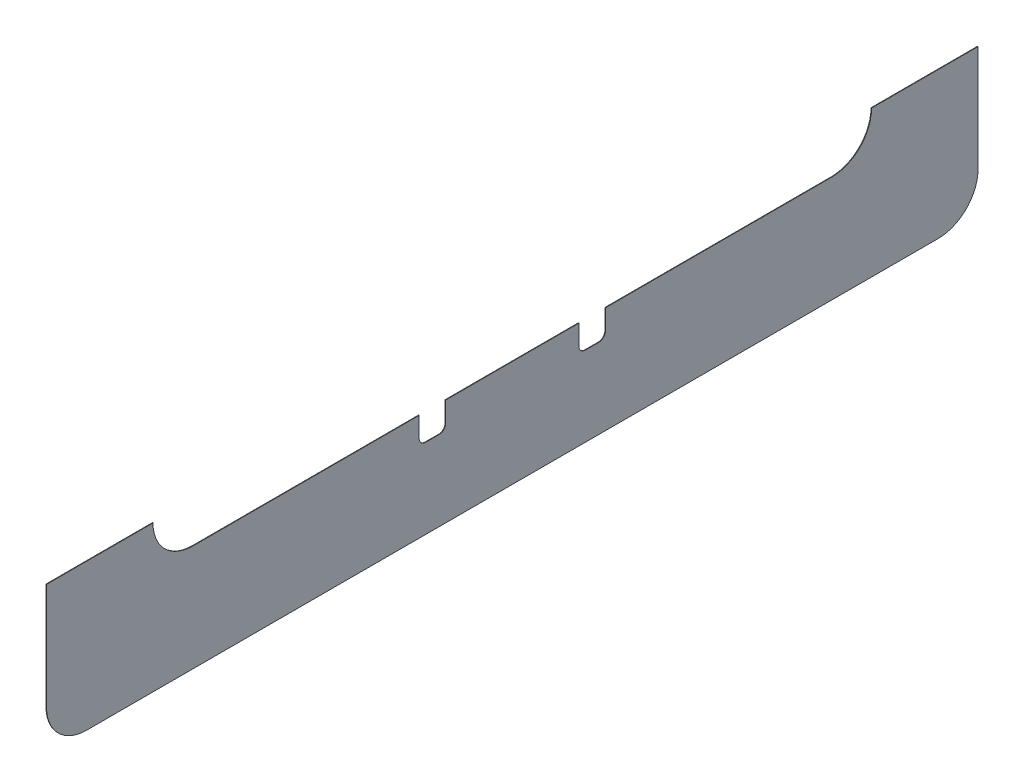
ISO-10303-21;
HEADER;
FILE_DESCRIPTION(('STEP AP214'),'2;1');
FILE_NAME('part.step','',(''),(''),'','','');
FILE_SCHEMA(('AUTOMOTIVE_DESIGN { 1 0 10303 214 1 1 1 1 }'));
ENDSEC;
DATA;
#1=APPLICATION_CONTEXT('core data for automotive mechanical design processes');
#2=APPLICATION_PROTOCOL_DEFINITION('international standard','automotive_design',2000,#1);
#3=PRODUCT_CONTEXT('',#1,'mechanical');
#4=PRODUCT('Part','Part','',(#3));
#5=PRODUCT_RELATED_PRODUCT_CATEGORY('part','',(#4));
#6=PRODUCT_DEFINITION_FORMATION('','',#4);
#7=PRODUCT_DEFINITION_CONTEXT('part definition',#1,'design');
#8=PRODUCT_DEFINITION('design','',#6,#7);
#9=PRODUCT_DEFINITION_SHAPE('','',#8);
#10=(LENGTH_UNIT() NAMED_UNIT(*) SI_UNIT(.MILLI.,.METRE.));
#11=(NAMED_UNIT(*) PLANE_ANGLE_UNIT() SI_UNIT($,.RADIAN.));
#12=(NAMED_UNIT(*) SI_UNIT($,.STERADIAN.) SOLID_ANGLE_UNIT());
#13=UNCERTAINTY_MEASURE_WITH_UNIT(LENGTH_MEASURE(1.E-05),#10,'distance_accuracy_value','');
#14=(GEOMETRIC_REPRESENTATION_CONTEXT(3) GLOBAL_UNCERTAINTY_ASSIGNED_CONTEXT((#13)) GLOBAL_UNIT_ASSIGNED_CONTEXT((#10,
#11,#12)) REPRESENTATION_CONTEXT('',''));
#15=CARTESIAN_POINT('',(0.,0.,0.));
#16=DIRECTION('',(0.,0.,1.));
#17=DIRECTION('',(1.,0.,0.));
#18=AXIS2_PLACEMENT_3D('',#15,#16,#17);
#19=CARTESIAN_POINT('',(0.254,0.,0.));
#20=DIRECTION('',(1.,0.,0.));
#21=DIRECTION('',(0.,0.,-1.));
#22=AXIS2_PLACEMENT_3D('',#19,#20,#21);
#23=PLANE('',#22);
#24=DIRECTION('',(0.,0.,1.));
#25=VECTOR('',#24,1.);
#26=CARTESIAN_POINT('',(0.254,-215.9,-222.25));
#27=LINE('',#26,#25);
#28=CARTESIAN_POINT('',(0.254,-215.9,171.45));
#29=VERTEX_POINT('',#28);
#30=CARTESIAN_POINT('',(0.254,-215.9,222.25));
#31=VERTEX_POINT('',#30);
#32=EDGE_CURVE('E194',#29,#31,#27,.T.);
#33=ORIENTED_EDGE('',*,*,#32,.T.);
#34=DIRECTION('',(0.,-1.,0.));
#35=VECTOR('',#34,1.);
#36=CARTESIAN_POINT('',(0.254,0.,222.25));
#37=LINE('',#36,#35);
#38=CARTESIAN_POINT('',(0.254,-266.7,222.25));
#39=VERTEX_POINT('',#38);
#40=EDGE_CURVE('E352',#31,#39,#37,.T.);
#41=ORIENTED_EDGE('',*,*,#40,.T.);
#42=CARTESIAN_POINT('',(0.254,-266.7,203.2));
#43=DIRECTION('',(1.,0.,0.));
#44=DIRECTION('',(0.,0.,-1.));
#45=AXIS2_PLACEMENT_3D('',#42,#43,#44);
#46=CIRCLE('',#45,19.0500000000001);
#47=CARTESIAN_POINT('',(0.254,-285.75,203.2));
#48=VERTEX_POINT('',#47);
#49=EDGE_CURVE('E354',#48,#39,#46,.F.);
#50=ORIENTED_EDGE('',*,*,#49,.F.);
#51=DIRECTION('',(0.,0.,-1.));
#52=VECTOR('',#51,1.);
#53=CARTESIAN_POINT('',(0.254,-285.75,0.));
#54=LINE('',#53,#52);
#55=CARTESIAN_POINT('',(0.254,-285.75,-203.2));
#56=VERTEX_POINT('',#55);
#57=EDGE_CURVE('E213',#48,#56,#54,.T.);
#58=ORIENTED_EDGE('',*,*,#57,.T.);
#59=CARTESIAN_POINT('',(0.254,-266.7,-203.2));
#60=DIRECTION('',(1.,0.,0.));
#61=DIRECTION('',(0.,0.,-1.));
#62=AXIS2_PLACEMENT_3D('',#59,#60,#61);
#63=CIRCLE('',#62,19.0500000000001);
#64=CARTESIAN_POINT('',(0.254,-266.7,-222.25));
#65=VERTEX_POINT('',#64);
#66=EDGE_CURVE('E207',#56,#65,#63,.T.);
#67=ORIENTED_EDGE('',*,*,#66,.T.);
#68=DIRECTION('',(0.,-1.,0.));
#69=VECTOR('',#68,1.);
#70=CARTESIAN_POINT('',(0.254,0.,-222.25));
#71=LINE('',#70,#69);
#72=CARTESIAN_POINT('',(0.254,-215.9,-222.25));
#73=VERTEX_POINT('',#72);
#74=EDGE_CURVE('E200',#73,#65,#71,.T.);
#75=ORIENTED_EDGE('',*,*,#74,.F.);
#76=CARTESIAN_POINT('',(0.254,-215.9,-171.45));
#77=VERTEX_POINT('',#76);
#78=EDGE_CURVE('E183',#73,#77,#27,.T.);
#79=ORIENTED_EDGE('',*,*,#78,.T.);
#80=CARTESIAN_POINT('',(0.254,-215.9,-152.4));
#81=DIRECTION('',(1.,0.,0.));
#82=DIRECTION('',(0.,0.,-1.));
#83=AXIS2_PLACEMENT_3D('',#80,#81,#82);
#84=CIRCLE('',#83,19.05);
#85=CARTESIAN_POINT('',(0.254,-234.95,-152.4));
#86=VERTEX_POINT('',#85);
#87=EDGE_CURVE('E209',#77,#86,#84,.F.);
#88=ORIENTED_EDGE('',*,*,#87,.T.);
#89=DIRECTION('',(0.,0.,-1.));
#90=VECTOR('',#89,1.);
#91=CARTESIAN_POINT('',(0.254,-234.95,0.));
#92=LINE('',#91,#90);
#93=CARTESIAN_POINT('',(0.254,-234.95,-44.45));
#94=VERTEX_POINT('',#93);
#95=EDGE_CURVE('E239',#94,#86,#92,.T.);
#96=ORIENTED_EDGE('',*,*,#95,.F.);
#97=DIRECTION('',(0.,-1.,0.));
#98=VECTOR('',#97,1.);
#99=CARTESIAN_POINT('',(0.254,-234.95,-44.45));
#100=LINE('',#99,#98);
#101=CARTESIAN_POINT('',(0.254,-244.475,-44.45));
#102=VERTEX_POINT('',#101);
#103=EDGE_CURVE('E307',#94,#102,#100,.T.);
#104=ORIENTED_EDGE('',*,*,#103,.T.);
#105=CARTESIAN_POINT('',(0.254,-244.475,-41.275));
#106=DIRECTION('',(-1.,0.,0.));
#107=DIRECTION('',(0.,0.,-1.));
#108=AXIS2_PLACEMENT_3D('',#105,#106,#107);
#109=CIRCLE('',#108,3.17500000000001);
#110=CARTESIAN_POINT('',(0.254,-247.65,-41.275));
#111=VERTEX_POINT('',#110);
#112=EDGE_CURVE('E310',#102,#111,#109,.T.);
#113=ORIENTED_EDGE('',*,*,#112,.T.);
#114=DIRECTION('',(0.,0.,1.));
#115=VECTOR('',#114,1.);
#116=CARTESIAN_POINT('',(0.254,-247.65,-41.275));
#117=LINE('',#116,#115);
#118=CARTESIAN_POINT('',(0.254,-247.65,-34.925));
#119=VERTEX_POINT('',#118);
#120=EDGE_CURVE('E314',#111,#119,#117,.T.);
#121=ORIENTED_EDGE('',*,*,#120,.T.);
#122=CARTESIAN_POINT('',(0.254,-244.475,-34.925));
#123=DIRECTION('',(-1.,0.,0.));
#124=DIRECTION('',(0.,0.,1.));
#125=AXIS2_PLACEMENT_3D('',#122,#123,#124);
#126=CIRCLE('',#125,3.175);
#127=CARTESIAN_POINT('',(0.254,-244.475,-31.75));
#128=VERTEX_POINT('',#127);
#129=EDGE_CURVE('E317',#119,#128,#126,.T.);
#130=ORIENTED_EDGE('',*,*,#129,.T.);
#131=DIRECTION('',(0.,1.,0.));
#132=VECTOR('',#131,1.);
#133=CARTESIAN_POINT('',(0.254,-234.95,-31.75));
#134=LINE('',#133,#132);
#135=CARTESIAN_POINT('',(0.254,-234.95,-31.75));
#136=VERTEX_POINT('',#135);
#137=EDGE_CURVE('E320',#128,#136,#134,.T.);
#138=ORIENTED_EDGE('',*,*,#137,.T.);
#139=CARTESIAN_POINT('',(0.254,-234.95,31.75));
#140=VERTEX_POINT('',#139);
#141=EDGE_CURVE('E350',#140,#136,#92,.T.);
#142=ORIENTED_EDGE('',*,*,#141,.F.);
#143=DIRECTION('',(0.,1.,0.));
#144=VECTOR('',#143,1.);
#145=CARTESIAN_POINT('',(0.254,-234.95,31.75));
#146=LINE('',#145,#144);
#147=CARTESIAN_POINT('',(0.254,-244.475,31.75));
#148=VERTEX_POINT('',#147);
#149=EDGE_CURVE('E58',#148,#140,#146,.T.);
#150=ORIENTED_EDGE('',*,*,#149,.F.);
#151=CARTESIAN_POINT('',(0.254,-244.475,34.925));
#152=DIRECTION('',(1.,0.,0.));
#153=DIRECTION('',(0.,0.,-1.));
#154=AXIS2_PLACEMENT_3D('',#151,#152,#153);
#155=CIRCLE('',#154,3.175);
#156=CARTESIAN_POINT('',(0.254,-247.65,34.925));
#157=VERTEX_POINT('',#156);
#158=EDGE_CURVE('E370',#157,#148,#155,.T.);
#159=ORIENTED_EDGE('',*,*,#158,.F.);
#160=DIRECTION('',(0.,0.,-1.));
#161=VECTOR('',#160,1.);
#162=CARTESIAN_POINT('',(0.254,-247.65,41.275));
#163=LINE('',#162,#161);
#164=CARTESIAN_POINT('',(0.254,-247.65,41.275));
#165=VERTEX_POINT('',#164);
#166=EDGE_CURVE('E371',#165,#157,#163,.T.);
#167=ORIENTED_EDGE('',*,*,#166,.F.);
#168=CARTESIAN_POINT('',(0.254,-244.475,41.275));
#169=DIRECTION('',(1.,0.,0.));
#170=DIRECTION('',(0.,0.,1.));
#171=AXIS2_PLACEMENT_3D('',#168,#169,#170);
#172=CIRCLE('',#171,3.17500000000001);
#173=CARTESIAN_POINT('',(0.254,-244.475,44.45));
#174=VERTEX_POINT('',#173);
#175=EDGE_CURVE('E286',#174,#165,#172,.T.);
#176=ORIENTED_EDGE('',*,*,#175,.F.);
#177=DIRECTION('',(0.,-1.,0.));
#178=VECTOR('',#177,1.);
#179=CARTESIAN_POINT('',(0.254,-234.95,44.45));
#180=LINE('',#179,#178);
#181=CARTESIAN_POINT('',(0.254,-234.95,44.45));
#182=VERTEX_POINT('',#181);
#183=EDGE_CURVE('E294',#182,#174,#180,.T.);
#184=ORIENTED_EDGE('',*,*,#183,.F.);
#185=CARTESIAN_POINT('',(0.254,-234.95,152.4));
#186=VERTEX_POINT('',#185);
#187=EDGE_CURVE('E270',#186,#182,#92,.T.);
#188=ORIENTED_EDGE('',*,*,#187,.F.);
#189=CARTESIAN_POINT('',(0.254,-215.9,152.4));
#190=DIRECTION('',(1.,0.,0.));
#191=DIRECTION('',(0.,0.,-1.));
#192=AXIS2_PLACEMENT_3D('',#189,#190,#191);
#193=CIRCLE('',#192,19.05);
#194=EDGE_CURVE('E265',#186,#29,#193,.F.);
#195=ORIENTED_EDGE('',*,*,#194,.T.);
#196=EDGE_LOOP('',(#33,#41,#50,#58,#67,#75,#79,#88,#96,#104,#113,#121,#130,#138,#142,#150,#159,
#167,#176,#184,#188,#195));
#197=FACE_BOUND('',#196,.T.);
#198=ADVANCED_FACE('F35',(#197),#23,.T.);
#199=CARTESIAN_POINT('',(0.,0.,0.));
#200=DIRECTION('',(1.,0.,0.));
#201=DIRECTION('',(0.,0.,-1.));
#202=AXIS2_PLACEMENT_3D('',#199,#200,#201);
#203=PLANE('',#202);
#204=DIRECTION('',(0.,-1.,0.));
#205=VECTOR('',#204,1.);
#206=CARTESIAN_POINT('',(0.,0.,222.25));
#207=LINE('',#206,#205);
#208=CARTESIAN_POINT('',(0.,-215.9,222.25));
#209=VERTEX_POINT('',#208);
#210=CARTESIAN_POINT('',(0.,-266.7,222.25));
#211=VERTEX_POINT('',#210);
#212=EDGE_CURVE('E225',#209,#211,#207,.T.);
#213=ORIENTED_EDGE('',*,*,#212,.F.);
#214=DIRECTION('',(0.,0.,1.));
#215=VECTOR('',#214,1.);
#216=CARTESIAN_POINT('',(0.,-215.9,-222.25));
#217=LINE('',#216,#215);
#218=CARTESIAN_POINT('',(0.,-215.9,171.45));
#219=VERTEX_POINT('',#218);
#220=EDGE_CURVE('E50',#219,#209,#217,.T.);
#221=ORIENTED_EDGE('',*,*,#220,.F.);
#222=CARTESIAN_POINT('',(0.,-215.9,152.4));
#223=DIRECTION('',(1.,0.,0.));
#224=DIRECTION('',(0.,0.,-1.));
#225=AXIS2_PLACEMENT_3D('',#222,#223,#224);
#226=CIRCLE('',#225,19.05);
#227=CARTESIAN_POINT('',(0.,-234.95,152.4));
#228=VERTEX_POINT('',#227);
#229=EDGE_CURVE('E220',#228,#219,#226,.F.);
#230=ORIENTED_EDGE('',*,*,#229,.F.);
#231=DIRECTION('',(0.,0.,-1.));
#232=VECTOR('',#231,1.);
#233=CARTESIAN_POINT('',(0.,-234.95,0.));
#234=LINE('',#233,#232);
#235=CARTESIAN_POINT('',(0.,-234.95,44.45));
#236=VERTEX_POINT('',#235);
#237=EDGE_CURVE('E217',#228,#236,#234,.T.);
#238=ORIENTED_EDGE('',*,*,#237,.T.);
#239=DIRECTION('',(0.,-1.,0.));
#240=VECTOR('',#239,1.);
#241=CARTESIAN_POINT('',(0.,-234.95,44.45));
#242=LINE('',#241,#240);
#243=CARTESIAN_POINT('',(0.,-244.475,44.45));
#244=VERTEX_POINT('',#243);
#245=EDGE_CURVE('E274',#236,#244,#242,.T.);
#246=ORIENTED_EDGE('',*,*,#245,.T.);
#247=CARTESIAN_POINT('',(0.,-244.475,41.275));
#248=DIRECTION('',(1.,0.,0.));
#249=DIRECTION('',(0.,0.,1.));
#250=AXIS2_PLACEMENT_3D('',#247,#248,#249);
#251=CIRCLE('',#250,3.17500000000001);
#252=CARTESIAN_POINT('',(0.,-247.65,41.275));
#253=VERTEX_POINT('',#252);
#254=EDGE_CURVE('E276',#244,#253,#251,.T.);
#255=ORIENTED_EDGE('',*,*,#254,.T.);
#256=DIRECTION('',(0.,0.,-1.));
#257=VECTOR('',#256,1.);
#258=CARTESIAN_POINT('',(0.,-247.65,41.275));
#259=LINE('',#258,#257);
#260=CARTESIAN_POINT('',(0.,-247.65,34.925));
#261=VERTEX_POINT('',#260);
#262=EDGE_CURVE('E291',#253,#261,#259,.T.);
#263=ORIENTED_EDGE('',*,*,#262,.T.);
#264=CARTESIAN_POINT('',(0.,-244.475,34.925));
#265=DIRECTION('',(1.,0.,0.));
#266=DIRECTION('',(0.,0.,-1.));
#267=AXIS2_PLACEMENT_3D('',#264,#265,#266);
#268=CIRCLE('',#267,3.175);
#269=CARTESIAN_POINT('',(0.,-244.475,31.75));
#270=VERTEX_POINT('',#269);
#271=EDGE_CURVE('E282',#261,#270,#268,.T.);
#272=ORIENTED_EDGE('',*,*,#271,.T.);
#273=DIRECTION('',(0.,1.,0.));
#274=VECTOR('',#273,1.);
#275=CARTESIAN_POINT('',(0.,-234.95,31.75));
#276=LINE('',#275,#274);
#277=CARTESIAN_POINT('',(0.,-234.95,31.75));
#278=VERTEX_POINT('',#277);
#279=EDGE_CURVE('E279',#270,#278,#276,.T.);
#280=ORIENTED_EDGE('',*,*,#279,.T.);
#281=CARTESIAN_POINT('',(0.,-234.95,-31.75));
#282=VERTEX_POINT('',#281);
#283=EDGE_CURVE('E221',#278,#282,#234,.T.);
#284=ORIENTED_EDGE('',*,*,#283,.T.);
#285=DIRECTION('',(0.,1.,0.));
#286=VECTOR('',#285,1.);
#287=CARTESIAN_POINT('',(0.,-234.95,-31.75));
#288=LINE('',#287,#286);
#289=CARTESIAN_POINT('',(0.,-244.475,-31.75));
#290=VERTEX_POINT('',#289);
#291=EDGE_CURVE('E311',#290,#282,#288,.T.);
#292=ORIENTED_EDGE('',*,*,#291,.F.);
#293=CARTESIAN_POINT('',(0.,-244.475,-34.925));
#294=DIRECTION('',(-1.,0.,0.));
#295=DIRECTION('',(0.,0.,1.));
#296=AXIS2_PLACEMENT_3D('',#293,#294,#295);
#297=CIRCLE('',#296,3.175);
#298=CARTESIAN_POINT('',(0.,-247.65,-34.925));
#299=VERTEX_POINT('',#298);
#300=EDGE_CURVE('E331',#299,#290,#297,.T.);
#301=ORIENTED_EDGE('',*,*,#300,.F.);
#302=DIRECTION('',(0.,0.,1.));
#303=VECTOR('',#302,1.);
#304=CARTESIAN_POINT('',(0.,-247.65,-41.275));
#305=LINE('',#304,#303);
#306=CARTESIAN_POINT('',(0.,-247.65,-41.275));
#307=VERTEX_POINT('',#306);
#308=EDGE_CURVE('E328',#307,#299,#305,.T.);
#309=ORIENTED_EDGE('',*,*,#308,.F.);
#310=CARTESIAN_POINT('',(0.,-244.475,-41.275));
#311=DIRECTION('',(-1.,0.,0.));
#312=DIRECTION('',(0.,0.,-1.));
#313=AXIS2_PLACEMENT_3D('',#310,#311,#312);
#314=CIRCLE('',#313,3.17500000000001);
#315=CARTESIAN_POINT('',(0.,-244.475,-44.45));
#316=VERTEX_POINT('',#315);
#317=EDGE_CURVE('E325',#316,#307,#314,.T.);
#318=ORIENTED_EDGE('',*,*,#317,.F.);
#319=DIRECTION('',(0.,-1.,0.));
#320=VECTOR('',#319,1.);
#321=CARTESIAN_POINT('',(0.,-234.95,-44.45));
#322=LINE('',#321,#320);
#323=CARTESIAN_POINT('',(0.,-234.95,-44.45));
#324=VERTEX_POINT('',#323);
#325=EDGE_CURVE('E297',#324,#316,#322,.T.);
#326=ORIENTED_EDGE('',*,*,#325,.F.);
#327=CARTESIAN_POINT('',(0.,-234.95,-152.4));
#328=VERTEX_POINT('',#327);
#329=EDGE_CURVE('E222',#324,#328,#234,.T.);
#330=ORIENTED_EDGE('',*,*,#329,.T.);
#331=CARTESIAN_POINT('',(0.,-215.9,-152.4));
#332=DIRECTION('',(1.,0.,0.));
#333=DIRECTION('',(0.,0.,-1.));
#334=AXIS2_PLACEMENT_3D('',#331,#332,#333);
#335=CIRCLE('',#334,19.05);
#336=CARTESIAN_POINT('',(0.,-215.9,-171.45));
#337=VERTEX_POINT('',#336);
#338=EDGE_CURVE('E236',#337,#328,#335,.F.);
#339=ORIENTED_EDGE('',*,*,#338,.F.);
#340=CARTESIAN_POINT('',(0.,-215.9,-222.25));
#341=VERTEX_POINT('',#340);
#342=EDGE_CURVE('E262',#341,#337,#217,.T.);
#343=ORIENTED_EDGE('',*,*,#342,.F.);
#344=DIRECTION('',(0.,-1.,0.));
#345=VECTOR('',#344,1.);
#346=CARTESIAN_POINT('',(0.,0.,-222.25));
#347=LINE('',#346,#345);
#348=CARTESIAN_POINT('',(0.,-266.7,-222.25));
#349=VERTEX_POINT('',#348);
#350=EDGE_CURVE('E202',#341,#349,#347,.T.);
#351=ORIENTED_EDGE('',*,*,#350,.T.);
#352=CARTESIAN_POINT('',(0.,-266.7,-203.2));
#353=DIRECTION('',(1.,0.,0.));
#354=DIRECTION('',(0.,0.,-1.));
#355=AXIS2_PLACEMENT_3D('',#352,#353,#354);
#356=CIRCLE('',#355,19.0500000000001);
#357=CARTESIAN_POINT('',(0.,-285.75,-203.2));
#358=VERTEX_POINT('',#357);
#359=EDGE_CURVE('E232',#358,#349,#356,.T.);
#360=ORIENTED_EDGE('',*,*,#359,.F.);
#361=DIRECTION('',(0.,0.,-1.));
#362=VECTOR('',#361,1.);
#363=CARTESIAN_POINT('',(0.,-285.75,0.));
#364=LINE('',#363,#362);
#365=CARTESIAN_POINT('',(0.,-285.75,203.2));
#366=VERTEX_POINT('',#365);
#367=EDGE_CURVE('E230',#366,#358,#364,.T.);
#368=ORIENTED_EDGE('',*,*,#367,.F.);
#369=CARTESIAN_POINT('',(0.,-266.7,203.2));
#370=DIRECTION('',(1.,0.,0.));
#371=DIRECTION('',(0.,0.,-1.));
#372=AXIS2_PLACEMENT_3D('',#369,#370,#371);
#373=CIRCLE('',#372,19.0500000000001);
#374=EDGE_CURVE('E227',#366,#211,#373,.F.);
#375=ORIENTED_EDGE('',*,*,#374,.T.);
#376=EDGE_LOOP('',(#213,#221,#230,#238,#246,#255,#263,#272,#280,#284,#292,#301,#309,#318,#326,
#330,#339,#343,#351,#360,#368,#375));
#377=FACE_BOUND('',#376,.T.);
#378=ADVANCED_FACE('F260',(#377),#203,.F.);
#379=CARTESIAN_POINT('',(0.254,-234.95,0.));
#380=DIRECTION('',(0.,1.,0.));
#381=DIRECTION('',(0.,0.,1.));
#382=AXIS2_PLACEMENT_3D('',#379,#380,#381);
#383=PLANE('',#382);
#384=ORIENTED_EDGE('',*,*,#187,.T.);
#385=DIRECTION('',(-1.,0.,0.));
#386=VECTOR('',#385,1.);
#387=CARTESIAN_POINT('',(0.254,-234.95,44.45));
#388=LINE('',#387,#386);
#389=EDGE_CURVE('E271',#182,#236,#388,.T.);
#390=ORIENTED_EDGE('',*,*,#389,.T.);
#391=ORIENTED_EDGE('',*,*,#237,.F.);
#392=DIRECTION('',(-1.,0.,0.));
#393=VECTOR('',#392,1.);
#394=CARTESIAN_POINT('',(0.254,-234.95,152.4));
#395=LINE('',#394,#393);
#396=EDGE_CURVE('E11',#186,#228,#395,.T.);
#397=ORIENTED_EDGE('',*,*,#396,.F.);
#398=EDGE_LOOP('',(#384,#390,#391,#397));
#399=FACE_BOUND('',#398,.T.);
#400=ADVANCED_FACE('F37',(#399),#383,.T.);
#401=ORIENTED_EDGE('',*,*,#283,.F.);
#402=DIRECTION('',(-1.,0.,0.));
#403=VECTOR('',#402,1.);
#404=CARTESIAN_POINT('',(0.254,-234.95,31.75));
#405=LINE('',#404,#403);
#406=EDGE_CURVE('E304',#140,#278,#405,.T.);
#407=ORIENTED_EDGE('',*,*,#406,.F.);
#408=ORIENTED_EDGE('',*,*,#141,.T.);
#409=DIRECTION('',(-1.,0.,0.));
#410=VECTOR('',#409,1.);
#411=CARTESIAN_POINT('',(0.254,-234.95,-31.75));
#412=LINE('',#411,#410);
#413=EDGE_CURVE('E338',#136,#282,#412,.T.);
#414=ORIENTED_EDGE('',*,*,#413,.T.);
#415=EDGE_LOOP('',(#401,#407,#408,#414));
#416=FACE_BOUND('',#415,.T.);
#417=ADVANCED_FACE('F393',(#416),#383,.T.);
#418=DIRECTION('',(-1.,0.,0.));
#419=VECTOR('',#418,1.);
#420=CARTESIAN_POINT('',(0.254,-234.95,-44.45));
#421=LINE('',#420,#419);
#422=EDGE_CURVE('E336',#94,#324,#421,.T.);
#423=ORIENTED_EDGE('',*,*,#422,.F.);
#424=ORIENTED_EDGE('',*,*,#95,.T.);
#425=DIRECTION('',(-1.,0.,0.));
#426=VECTOR('',#425,1.);
#427=CARTESIAN_POINT('',(0.254,-234.95,-152.4));
#428=LINE('',#427,#426);
#429=EDGE_CURVE('E211',#86,#328,#428,.T.);
#430=ORIENTED_EDGE('',*,*,#429,.T.);
#431=ORIENTED_EDGE('',*,*,#329,.F.);
#432=EDGE_LOOP('',(#423,#424,#430,#431));
#433=FACE_BOUND('',#432,.T.);
#434=ADVANCED_FACE('F401',(#433),#383,.T.);
#435=CARTESIAN_POINT('',(0.254,-215.9,152.4));
#436=DIRECTION('',(-1.,0.,0.));
#437=DIRECTION('',(0.,0.,1.));
#438=AXIS2_PLACEMENT_3D('',#435,#436,#437);
#439=CYLINDRICAL_SURFACE('',#438,19.05);
#440=ORIENTED_EDGE('',*,*,#229,.T.);
#441=DIRECTION('',(-1.,0.,0.));
#442=VECTOR('',#441,1.);
#443=CARTESIAN_POINT('',(0.254,-215.9,171.45));
#444=LINE('',#443,#442);
#445=EDGE_CURVE('E43',#29,#219,#444,.T.);
#446=ORIENTED_EDGE('',*,*,#445,.F.);
#447=ORIENTED_EDGE('',*,*,#194,.F.);
#448=ORIENTED_EDGE('',*,*,#396,.T.);
#449=EDGE_LOOP('',(#440,#446,#447,#448));
#450=FACE_BOUND('',#449,.T.);
#451=ADVANCED_FACE('F264',(#450),#439,.F.);
#452=CARTESIAN_POINT('',(0.254,0.,222.25));
#453=DIRECTION('',(0.,0.,-1.));
#454=DIRECTION('',(-1.,0.,0.));
#455=AXIS2_PLACEMENT_3D('',#452,#453,#454);
#456=PLANE('',#455);
#457=ORIENTED_EDGE('',*,*,#40,.F.);
#458=DIRECTION('',(-1.,0.,0.));
#459=VECTOR('',#458,1.);
#460=CARTESIAN_POINT('',(0.254,-215.9,222.25));
#461=LINE('',#460,#459);
#462=EDGE_CURVE('E203',#31,#209,#461,.T.);
#463=ORIENTED_EDGE('',*,*,#462,.T.);
#464=ORIENTED_EDGE('',*,*,#212,.T.);
#465=DIRECTION('',(-1.,0.,0.));
#466=VECTOR('',#465,1.);
#467=CARTESIAN_POINT('',(0.254,-266.7,222.25));
#468=LINE('',#467,#466);
#469=EDGE_CURVE('E250',#39,#211,#468,.T.);
#470=ORIENTED_EDGE('',*,*,#469,.F.);
#471=EDGE_LOOP('',(#457,#463,#464,#470));
#472=FACE_BOUND('',#471,.T.);
#473=ADVANCED_FACE('F446',(#472),#456,.F.);
#474=CARTESIAN_POINT('',(0.254,-266.7,203.2));
#475=DIRECTION('',(-1.,0.,0.));
#476=DIRECTION('',(0.,0.,1.));
#477=AXIS2_PLACEMENT_3D('',#474,#475,#476);
#478=CYLINDRICAL_SURFACE('',#477,19.0500000000001);
#479=ORIENTED_EDGE('',*,*,#374,.F.);
#480=DIRECTION('',(-1.,0.,0.));
#481=VECTOR('',#480,1.);
#482=CARTESIAN_POINT('',(0.254,-285.75,203.2));
#483=LINE('',#482,#481);
#484=EDGE_CURVE('E248',#48,#366,#483,.T.);
#485=ORIENTED_EDGE('',*,*,#484,.F.);
#486=ORIENTED_EDGE('',*,*,#49,.T.);
#487=ORIENTED_EDGE('',*,*,#469,.T.);
#488=EDGE_LOOP('',(#479,#485,#486,#487));
#489=FACE_BOUND('',#488,.T.);
#490=ADVANCED_FACE('F443',(#489),#478,.T.);
#491=CARTESIAN_POINT('',(0.254,-285.75,0.));
#492=DIRECTION('',(0.,1.,0.));
#493=DIRECTION('',(0.,0.,1.));
#494=AXIS2_PLACEMENT_3D('',#491,#492,#493);
#495=PLANE('',#494);
#496=ORIENTED_EDGE('',*,*,#367,.T.);
#497=DIRECTION('',(-1.,0.,0.));
#498=VECTOR('',#497,1.);
#499=CARTESIAN_POINT('',(0.254,-285.75,-203.2));
#500=LINE('',#499,#498);
#501=EDGE_CURVE('E245',#56,#358,#500,.T.);
#502=ORIENTED_EDGE('',*,*,#501,.F.);
#503=ORIENTED_EDGE('',*,*,#57,.F.);
#504=ORIENTED_EDGE('',*,*,#484,.T.);
#505=EDGE_LOOP('',(#496,#502,#503,#504));
#506=FACE_BOUND('',#505,.T.);
#507=ADVANCED_FACE('F360',(#506),#495,.F.);
#508=CARTESIAN_POINT('',(0.254,-266.7,-203.2));
#509=DIRECTION('',(-1.,0.,0.));
#510=DIRECTION('',(0.,0.,1.));
#511=AXIS2_PLACEMENT_3D('',#508,#509,#510);
#512=CYLINDRICAL_SURFACE('',#511,19.0500000000001);
#513=ORIENTED_EDGE('',*,*,#359,.T.);
#514=DIRECTION('',(-1.,0.,0.));
#515=VECTOR('',#514,1.);
#516=CARTESIAN_POINT('',(0.254,-266.7,-222.25));
#517=LINE('',#516,#515);
#518=EDGE_CURVE('E243',#65,#349,#517,.T.);
#519=ORIENTED_EDGE('',*,*,#518,.F.);
#520=ORIENTED_EDGE('',*,*,#66,.F.);
#521=ORIENTED_EDGE('',*,*,#501,.T.);
#522=EDGE_LOOP('',(#513,#519,#520,#521));
#523=FACE_BOUND('',#522,.T.);
#524=ADVANCED_FACE('F364',(#523),#512,.T.);
#525=CARTESIAN_POINT('',(0.254,0.,-222.25));
#526=DIRECTION('',(0.,0.,-1.));
#527=DIRECTION('',(0.,1.,0.));
#528=AXIS2_PLACEMENT_3D('',#525,#526,#527);
#529=PLANE('',#528);
#530=DIRECTION('',(-1.,0.,0.));
#531=VECTOR('',#530,1.);
#532=CARTESIAN_POINT('',(0.254,-215.9,-222.25));
#533=LINE('',#532,#531);
#534=EDGE_CURVE('E186',#73,#341,#533,.T.);
#535=ORIENTED_EDGE('',*,*,#534,.F.);
#536=ORIENTED_EDGE('',*,*,#74,.T.);
#537=ORIENTED_EDGE('',*,*,#518,.T.);
#538=ORIENTED_EDGE('',*,*,#350,.F.);
#539=EDGE_LOOP('',(#535,#536,#537,#538));
#540=FACE_BOUND('',#539,.T.);
#541=ADVANCED_FACE('F198',(#540),#529,.T.);
#542=CARTESIAN_POINT('',(0.254,-215.9,-152.4));
#543=DIRECTION('',(-1.,0.,0.));
#544=DIRECTION('',(0.,0.,1.));
#545=AXIS2_PLACEMENT_3D('',#542,#543,#544);
#546=CYLINDRICAL_SURFACE('',#545,19.05);
#547=ORIENTED_EDGE('',*,*,#338,.T.);
#548=ORIENTED_EDGE('',*,*,#429,.F.);
#549=ORIENTED_EDGE('',*,*,#87,.F.);
#550=DIRECTION('',(-1.,0.,0.));
#551=VECTOR('',#550,1.);
#552=CARTESIAN_POINT('',(0.254,-215.9,-171.45));
#553=LINE('',#552,#551);
#554=EDGE_CURVE('E189',#77,#337,#553,.T.);
#555=ORIENTED_EDGE('',*,*,#554,.T.);
#556=EDGE_LOOP('',(#547,#548,#549,#555));
#557=FACE_BOUND('',#556,.T.);
#558=ADVANCED_FACE('F404',(#557),#546,.F.);
#559=CARTESIAN_POINT('',(0.254,-234.95,-44.45));
#560=DIRECTION('',(0.,0.,-1.));
#561=DIRECTION('',(0.,1.,0.));
#562=AXIS2_PLACEMENT_3D('',#559,#560,#561);
#563=PLANE('',#562);
#564=ORIENTED_EDGE('',*,*,#325,.T.);
#565=DIRECTION('',(-1.,0.,0.));
#566=VECTOR('',#565,1.);
#567=CARTESIAN_POINT('',(0.254,-244.475,-44.45));
#568=LINE('',#567,#566);
#569=EDGE_CURVE('E323',#102,#316,#568,.T.);
#570=ORIENTED_EDGE('',*,*,#569,.F.);
#571=ORIENTED_EDGE('',*,*,#103,.F.);
#572=ORIENTED_EDGE('',*,*,#422,.T.);
#573=EDGE_LOOP('',(#564,#570,#571,#572));
#574=FACE_BOUND('',#573,.T.);
#575=ADVANCED_FACE('F420',(#574),#563,.F.);
#576=CARTESIAN_POINT('',(0.254,-234.95,-31.75));
#577=DIRECTION('',(0.,0.,1.));
#578=DIRECTION('',(1.,0.,0.));
#579=AXIS2_PLACEMENT_3D('',#576,#577,#578);
#580=PLANE('',#579);
#581=ORIENTED_EDGE('',*,*,#291,.T.);
#582=ORIENTED_EDGE('',*,*,#413,.F.);
#583=ORIENTED_EDGE('',*,*,#137,.F.);
#584=DIRECTION('',(-1.,0.,0.));
#585=VECTOR('',#584,1.);
#586=CARTESIAN_POINT('',(0.254,-244.475,-31.75));
#587=LINE('',#586,#585);
#588=EDGE_CURVE('E341',#128,#290,#587,.T.);
#589=ORIENTED_EDGE('',*,*,#588,.T.);
#590=EDGE_LOOP('',(#581,#582,#583,#589));
#591=FACE_BOUND('',#590,.T.);
#592=ADVANCED_FACE('F407',(#591),#580,.F.);
#593=CARTESIAN_POINT('',(0.254,-244.475,-34.925));
#594=DIRECTION('',(-1.,0.,0.));
#595=DIRECTION('',(0.,0.,1.));
#596=AXIS2_PLACEMENT_3D('',#593,#594,#595);
#597=CYLINDRICAL_SURFACE('',#596,3.175);
#598=ORIENTED_EDGE('',*,*,#300,.T.);
#599=ORIENTED_EDGE('',*,*,#588,.F.);
#600=ORIENTED_EDGE('',*,*,#129,.F.);
#601=DIRECTION('',(-1.,0.,0.));
#602=VECTOR('',#601,1.);
#603=CARTESIAN_POINT('',(0.254,-247.65,-34.925));
#604=LINE('',#603,#602);
#605=EDGE_CURVE('E343',#119,#299,#604,.T.);
#606=ORIENTED_EDGE('',*,*,#605,.T.);
#607=EDGE_LOOP('',(#598,#599,#600,#606));
#608=FACE_BOUND('',#607,.T.);
#609=ADVANCED_FACE('F411',(#608),#597,.F.);
#610=CARTESIAN_POINT('',(0.254,-247.65,-41.275));
#611=DIRECTION('',(0.,-1.,0.));
#612=DIRECTION('',(0.,0.,-1.));
#613=AXIS2_PLACEMENT_3D('',#610,#611,#612);
#614=PLANE('',#613);
#615=ORIENTED_EDGE('',*,*,#308,.T.);
#616=ORIENTED_EDGE('',*,*,#605,.F.);
#617=ORIENTED_EDGE('',*,*,#120,.F.);
#618=DIRECTION('',(-1.,0.,0.));
#619=VECTOR('',#618,1.);
#620=CARTESIAN_POINT('',(0.254,-247.65,-41.275));
#621=LINE('',#620,#619);
#622=EDGE_CURVE('E345',#111,#307,#621,.T.);
#623=ORIENTED_EDGE('',*,*,#622,.T.);
#624=EDGE_LOOP('',(#615,#616,#617,#623));
#625=FACE_BOUND('',#624,.T.);
#626=ADVANCED_FACE('F415',(#625),#614,.F.);
#627=CARTESIAN_POINT('',(0.254,-244.475,-41.275));
#628=DIRECTION('',(-1.,0.,0.));
#629=DIRECTION('',(0.,0.,1.));
#630=AXIS2_PLACEMENT_3D('',#627,#628,#629);
#631=CYLINDRICAL_SURFACE('',#630,3.17500000000001);
#632=ORIENTED_EDGE('',*,*,#317,.T.);
#633=ORIENTED_EDGE('',*,*,#622,.F.);
#634=ORIENTED_EDGE('',*,*,#112,.F.);
#635=ORIENTED_EDGE('',*,*,#569,.T.);
#636=EDGE_LOOP('',(#632,#633,#634,#635));
#637=FACE_BOUND('',#636,.T.);
#638=ADVANCED_FACE('F418',(#637),#631,.F.);
#639=CARTESIAN_POINT('',(0.254,-234.95,44.45));
#640=DIRECTION('',(0.,0.,-1.));
#641=DIRECTION('',(0.,1.,0.));
#642=AXIS2_PLACEMENT_3D('',#639,#640,#641);
#643=PLANE('',#642);
#644=ORIENTED_EDGE('',*,*,#245,.F.);
#645=ORIENTED_EDGE('',*,*,#389,.F.);
#646=ORIENTED_EDGE('',*,*,#183,.T.);
#647=DIRECTION('',(-1.,0.,0.));
#648=VECTOR('',#647,1.);
#649=CARTESIAN_POINT('',(0.254,-244.475,44.45));
#650=LINE('',#649,#648);
#651=EDGE_CURVE('E295',#174,#244,#650,.T.);
#652=ORIENTED_EDGE('',*,*,#651,.T.);
#653=EDGE_LOOP('',(#644,#645,#646,#652));
#654=FACE_BOUND('',#653,.T.);
#655=ADVANCED_FACE('F473',(#654),#643,.T.);
#656=CARTESIAN_POINT('',(0.254,-244.475,41.275));
#657=DIRECTION('',(-1.,0.,0.));
#658=DIRECTION('',(0.,0.,1.));
#659=AXIS2_PLACEMENT_3D('',#656,#657,#658);
#660=CYLINDRICAL_SURFACE('',#659,3.17500000000001);
#661=ORIENTED_EDGE('',*,*,#254,.F.);
#662=ORIENTED_EDGE('',*,*,#651,.F.);
#663=ORIENTED_EDGE('',*,*,#175,.T.);
#664=DIRECTION('',(-1.,0.,0.));
#665=VECTOR('',#664,1.);
#666=CARTESIAN_POINT('',(0.254,-247.65,41.275));
#667=LINE('',#666,#665);
#668=EDGE_CURVE('E298',#165,#253,#667,.T.);
#669=ORIENTED_EDGE('',*,*,#668,.T.);
#670=EDGE_LOOP('',(#661,#662,#663,#669));
#671=FACE_BOUND('',#670,.T.);
#672=ADVANCED_FACE('F379',(#671),#660,.F.);
#673=CARTESIAN_POINT('',(0.254,-247.65,41.275));
#674=DIRECTION('',(0.,1.,0.));
#675=DIRECTION('',(0.,0.,1.));
#676=AXIS2_PLACEMENT_3D('',#673,#674,#675);
#677=PLANE('',#676);
#678=ORIENTED_EDGE('',*,*,#262,.F.);
#679=ORIENTED_EDGE('',*,*,#668,.F.);
#680=ORIENTED_EDGE('',*,*,#166,.T.);
#681=DIRECTION('',(-1.,0.,0.));
#682=VECTOR('',#681,1.);
#683=CARTESIAN_POINT('',(0.254,-247.65,34.925));
#684=LINE('',#683,#682);
#685=EDGE_CURVE('E300',#157,#261,#684,.T.);
#686=ORIENTED_EDGE('',*,*,#685,.T.);
#687=EDGE_LOOP('',(#678,#679,#680,#686));
#688=FACE_BOUND('',#687,.T.);
#689=ADVANCED_FACE('F382',(#688),#677,.T.);
#690=CARTESIAN_POINT('',(0.254,-244.475,34.925));
#691=DIRECTION('',(-1.,0.,0.));
#692=DIRECTION('',(0.,0.,1.));
#693=AXIS2_PLACEMENT_3D('',#690,#691,#692);
#694=CYLINDRICAL_SURFACE('',#693,3.175);
#695=ORIENTED_EDGE('',*,*,#271,.F.);
#696=ORIENTED_EDGE('',*,*,#685,.F.);
#697=ORIENTED_EDGE('',*,*,#158,.T.);
#698=DIRECTION('',(-1.,0.,0.));
#699=VECTOR('',#698,1.);
#700=CARTESIAN_POINT('',(0.254,-244.475,31.75));
#701=LINE('',#700,#699);
#702=EDGE_CURVE('E302',#148,#270,#701,.T.);
#703=ORIENTED_EDGE('',*,*,#702,.T.);
#704=EDGE_LOOP('',(#695,#696,#697,#703));
#705=FACE_BOUND('',#704,.T.);
#706=ADVANCED_FACE('F387',(#705),#694,.F.);
#707=CARTESIAN_POINT('',(0.254,-234.95,31.75));
#708=DIRECTION('',(0.,0.,1.));
#709=DIRECTION('',(1.,0.,0.));
#710=AXIS2_PLACEMENT_3D('',#707,#708,#709);
#711=PLANE('',#710);
#712=ORIENTED_EDGE('',*,*,#279,.F.);
#713=ORIENTED_EDGE('',*,*,#702,.F.);
#714=ORIENTED_EDGE('',*,*,#149,.T.);
#715=ORIENTED_EDGE('',*,*,#406,.T.);
#716=EDGE_LOOP('',(#712,#713,#714,#715));
#717=FACE_BOUND('',#716,.T.);
#718=ADVANCED_FACE('F389',(#717),#711,.T.);
#719=CARTESIAN_POINT('',(0.254,-215.9,-222.25));
#720=DIRECTION('',(0.,-1.,0.));
#721=DIRECTION('',(0.,0.,-1.));
#722=AXIS2_PLACEMENT_3D('',#719,#720,#721);
#723=PLANE('',#722);
#724=ORIENTED_EDGE('',*,*,#78,.F.);
#725=ORIENTED_EDGE('',*,*,#534,.T.);
#726=ORIENTED_EDGE('',*,*,#342,.T.);
#727=ORIENTED_EDGE('',*,*,#554,.F.);
#728=EDGE_LOOP('',(#724,#725,#726,#727));
#729=FACE_BOUND('',#728,.T.);
#730=ADVANCED_FACE('F185',(#729),#723,.F.);
#731=ORIENTED_EDGE('',*,*,#220,.T.);
#732=ORIENTED_EDGE('',*,*,#462,.F.);
#733=ORIENTED_EDGE('',*,*,#32,.F.);
#734=ORIENTED_EDGE('',*,*,#445,.T.);
#735=EDGE_LOOP('',(#731,#732,#733,#734));
#736=FACE_BOUND('',#735,.T.);
#737=ADVANCED_FACE('F253',(#736),#723,.F.);
#738=CLOSED_SHELL('',(#198,#378,#400,#417,#434,#451,#473,#490,#507,#524,#541,#558,#575,#592,
#609,#626,#638,#655,#672,#689,#706,#718,#730,#737));
#739=MANIFOLD_SOLID_BREP('B2',#738);
#740=ADVANCED_BREP_SHAPE_REPRESENTATION('',(#18,#739),#14);
#741=SHAPE_DEFINITION_REPRESENTATION(#9,#740);
ENDSEC;
END-ISO-10303-21;
